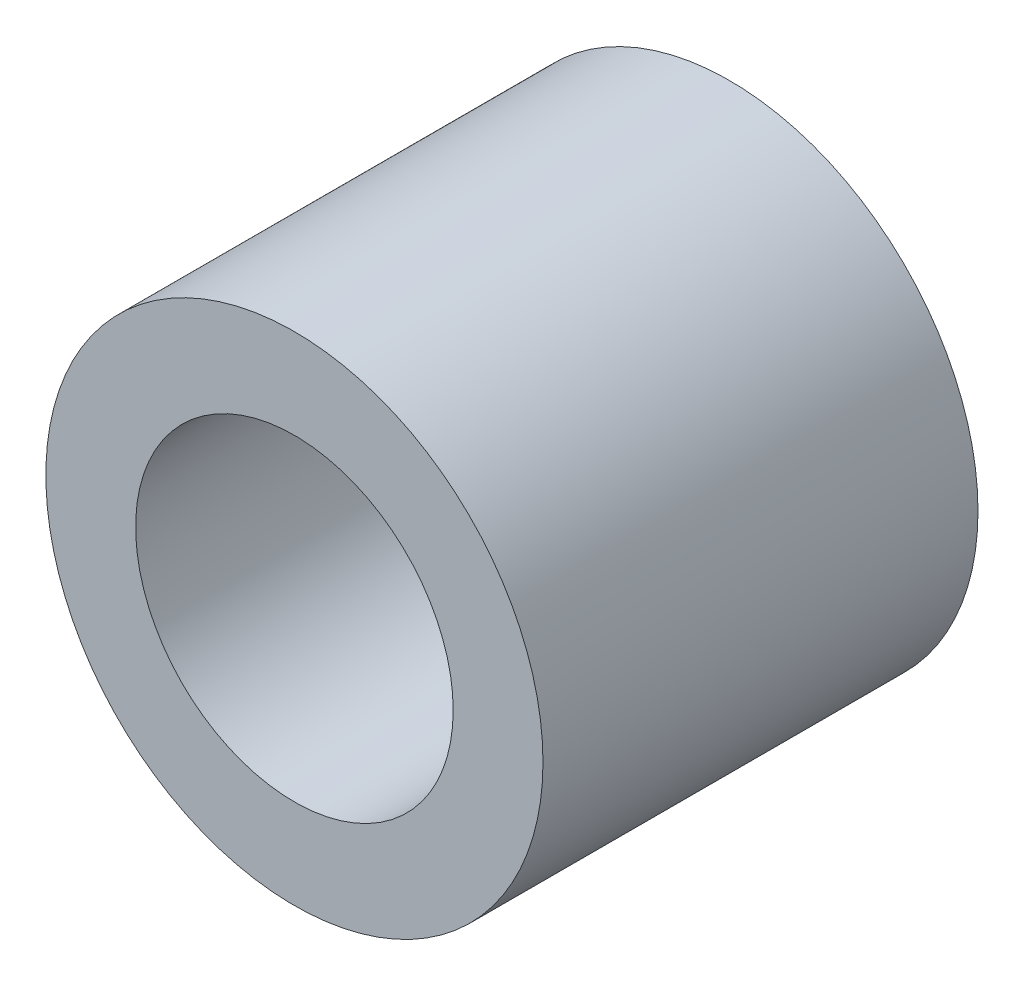
ISO-10303-21;
HEADER;
FILE_DESCRIPTION(('STEP AP214'),'2;1');
FILE_NAME('part.step','',(''),(''),'','','');
FILE_SCHEMA(('AUTOMOTIVE_DESIGN { 1 0 10303 214 1 1 1 1 }'));
ENDSEC;
DATA;
#1=APPLICATION_CONTEXT('core data for automotive mechanical design processes');
#2=APPLICATION_PROTOCOL_DEFINITION('international standard','automotive_design',2000,#1);
#3=PRODUCT_CONTEXT('',#1,'mechanical');
#4=PRODUCT('Part','Part','',(#3));
#5=PRODUCT_RELATED_PRODUCT_CATEGORY('part','',(#4));
#6=PRODUCT_DEFINITION_FORMATION('','',#4);
#7=PRODUCT_DEFINITION_CONTEXT('part definition',#1,'design');
#8=PRODUCT_DEFINITION('design','',#6,#7);
#9=PRODUCT_DEFINITION_SHAPE('','',#8);
#10=(LENGTH_UNIT() NAMED_UNIT(*) SI_UNIT(.MILLI.,.METRE.));
#11=(NAMED_UNIT(*) PLANE_ANGLE_UNIT() SI_UNIT($,.RADIAN.));
#12=(NAMED_UNIT(*) SI_UNIT($,.STERADIAN.) SOLID_ANGLE_UNIT());
#13=UNCERTAINTY_MEASURE_WITH_UNIT(LENGTH_MEASURE(1.E-05),#10,'distance_accuracy_value','');
#14=(GEOMETRIC_REPRESENTATION_CONTEXT(3) GLOBAL_UNCERTAINTY_ASSIGNED_CONTEXT((#13)) GLOBAL_UNIT_ASSIGNED_CONTEXT((#10,
#11,#12)) REPRESENTATION_CONTEXT('',''));
#15=CARTESIAN_POINT('',(0.,0.,0.));
#16=DIRECTION('',(0.,0.,1.));
#17=DIRECTION('',(1.,0.,0.));
#18=AXIS2_PLACEMENT_3D('',#15,#16,#17);
#19=CARTESIAN_POINT('',(0.,0.,7.00000000000001));
#20=DIRECTION('',(0.,0.,1.));
#21=DIRECTION('',(1.,0.,0.));
#22=AXIS2_PLACEMENT_3D('',#19,#20,#21);
#23=PLANE('',#22);
#24=CARTESIAN_POINT('',(0.,0.,7.00000000000001));
#25=DIRECTION('',(0.,0.,1.));
#26=DIRECTION('',(1.,0.,0.));
#27=AXIS2_PLACEMENT_3D('',#24,#25,#26);
#28=CIRCLE('',#27,4.);
#29=CARTESIAN_POINT('',(4.,0.,7.00000000000001));
#30=VERTEX_POINT('',#29);
#31=EDGE_CURVE('E10',#30,#30,#28,.T.);
#32=ORIENTED_EDGE('',*,*,#31,.T.);
#33=EDGE_LOOP('',(#32));
#34=FACE_BOUND('',#33,.T.);
#35=CARTESIAN_POINT('',(0.,0.,7.00000000000001));
#36=DIRECTION('',(0.,0.,1.));
#37=DIRECTION('',(1.,0.,0.));
#38=AXIS2_PLACEMENT_3D('',#35,#36,#37);
#39=CIRCLE('',#38,2.555);
#40=CARTESIAN_POINT('',(2.555,0.,7.00000000000001));
#41=VERTEX_POINT('',#40);
#42=EDGE_CURVE('E45',#41,#41,#39,.T.);
#43=ORIENTED_EDGE('',*,*,#42,.F.);
#44=EDGE_LOOP('',(#43));
#45=FACE_BOUND('',#44,.T.);
#46=ADVANCED_FACE('F34',(#34,#45),#23,.T.);
#47=CARTESIAN_POINT('',(0.,0.,0.));
#48=DIRECTION('',(0.,0.,1.));
#49=DIRECTION('',(1.,0.,0.));
#50=AXIS2_PLACEMENT_3D('',#47,#48,#49);
#51=PLANE('',#50);
#52=CARTESIAN_POINT('',(0.,0.,0.));
#53=DIRECTION('',(0.,0.,1.));
#54=DIRECTION('',(1.,0.,0.));
#55=AXIS2_PLACEMENT_3D('',#52,#53,#54);
#56=CIRCLE('',#55,4.);
#57=CARTESIAN_POINT('',(4.,0.,0.));
#58=VERTEX_POINT('',#57);
#59=EDGE_CURVE('E38',#58,#58,#56,.T.);
#60=ORIENTED_EDGE('',*,*,#59,.F.);
#61=EDGE_LOOP('',(#60));
#62=FACE_BOUND('',#61,.T.);
#63=CARTESIAN_POINT('',(0.,0.,0.));
#64=DIRECTION('',(0.,0.,1.));
#65=DIRECTION('',(1.,0.,0.));
#66=AXIS2_PLACEMENT_3D('',#63,#64,#65);
#67=CIRCLE('',#66,2.555);
#68=CARTESIAN_POINT('',(2.555,0.,0.));
#69=VERTEX_POINT('',#68);
#70=EDGE_CURVE('E47',#69,#69,#67,.T.);
#71=ORIENTED_EDGE('',*,*,#70,.T.);
#72=EDGE_LOOP('',(#71));
#73=FACE_BOUND('',#72,.T.);
#74=ADVANCED_FACE('F57',(#62,#73),#51,.F.);
#75=CARTESIAN_POINT('',(0.,0.,7.00000000000001));
#76=DIRECTION('',(0.,0.,-1.));
#77=DIRECTION('',(-1.,0.,0.));
#78=AXIS2_PLACEMENT_3D('',#75,#76,#77);
#79=CYLINDRICAL_SURFACE('',#78,4.);
#80=ORIENTED_EDGE('',*,*,#31,.F.);
#81=EDGE_LOOP('',(#80));
#82=FACE_BOUND('',#81,.T.);
#83=ORIENTED_EDGE('',*,*,#59,.T.);
#84=EDGE_LOOP('',(#83));
#85=FACE_BOUND('',#84,.T.);
#86=ADVANCED_FACE('F36',(#82,#85),#79,.T.);
#87=CARTESIAN_POINT('',(0.,0.,7.00000000000001));
#88=DIRECTION('',(0.,0.,-1.));
#89=DIRECTION('',(-1.,0.,0.));
#90=AXIS2_PLACEMENT_3D('',#87,#88,#89);
#91=CYLINDRICAL_SURFACE('',#90,2.555);
#92=ORIENTED_EDGE('',*,*,#42,.T.);
#93=EDGE_LOOP('',(#92));
#94=FACE_BOUND('',#93,.T.);
#95=ORIENTED_EDGE('',*,*,#70,.F.);
#96=EDGE_LOOP('',(#95));
#97=FACE_BOUND('',#96,.T.);
#98=ADVANCED_FACE('F53',(#94,#97),#91,.F.);
#99=CLOSED_SHELL('',(#46,#74,#86,#98));
#100=MANIFOLD_SOLID_BREP('B2',#99);
#101=ADVANCED_BREP_SHAPE_REPRESENTATION('',(#18,#100),#14);
#102=SHAPE_DEFINITION_REPRESENTATION(#9,#101);
ENDSEC;
END-ISO-10303-21;
